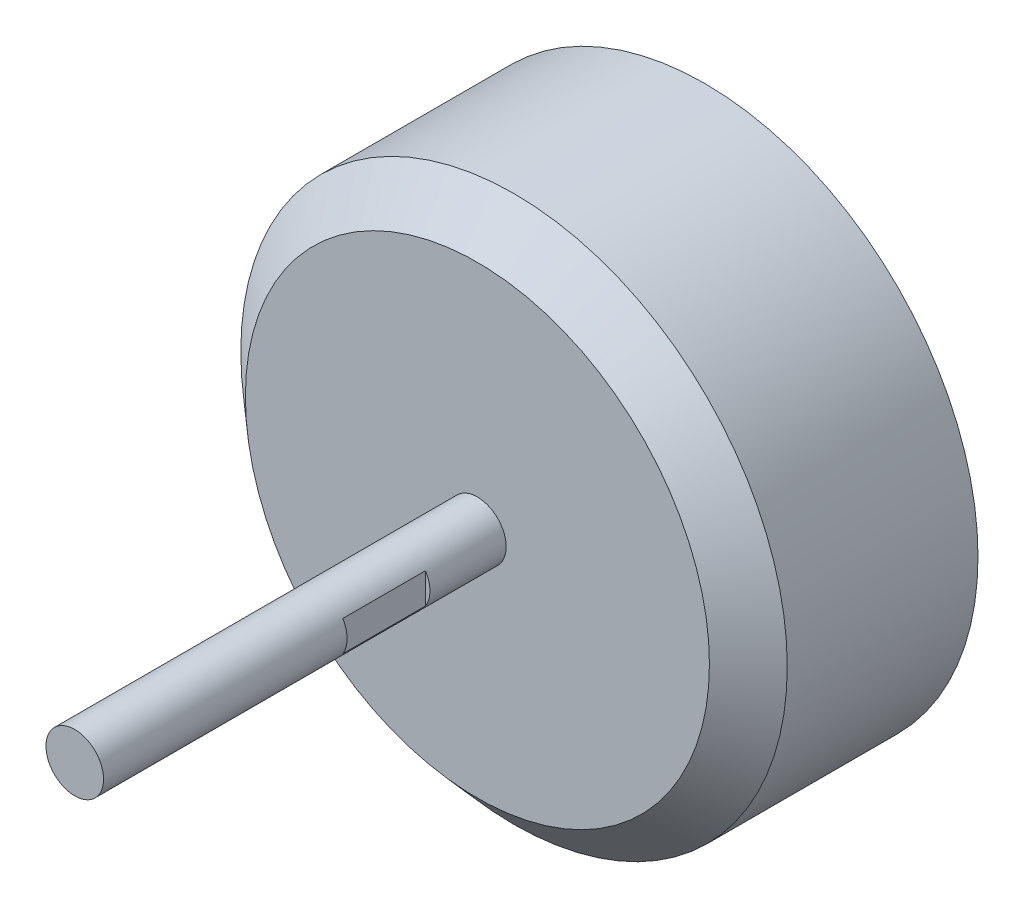
ISO-10303-21;
HEADER;
FILE_DESCRIPTION(('STEP AP214'),'2;1');
FILE_NAME('part.step','',(''),(''),'','','');
FILE_SCHEMA(('AUTOMOTIVE_DESIGN { 1 0 10303 214 1 1 1 1 }'));
ENDSEC;
DATA;
#1=APPLICATION_CONTEXT('core data for automotive mechanical design processes');
#2=APPLICATION_PROTOCOL_DEFINITION('international standard','automotive_design',2000,#1);
#3=PRODUCT_CONTEXT('',#1,'mechanical');
#4=PRODUCT('Part','Part','',(#3));
#5=PRODUCT_RELATED_PRODUCT_CATEGORY('part','',(#4));
#6=PRODUCT_DEFINITION_FORMATION('','',#4);
#7=PRODUCT_DEFINITION_CONTEXT('part definition',#1,'design');
#8=PRODUCT_DEFINITION('design','',#6,#7);
#9=PRODUCT_DEFINITION_SHAPE('','',#8);
#10=(LENGTH_UNIT() NAMED_UNIT(*) SI_UNIT(.MILLI.,.METRE.));
#11=(NAMED_UNIT(*) PLANE_ANGLE_UNIT() SI_UNIT($,.RADIAN.));
#12=(NAMED_UNIT(*) SI_UNIT($,.STERADIAN.) SOLID_ANGLE_UNIT());
#13=UNCERTAINTY_MEASURE_WITH_UNIT(LENGTH_MEASURE(1.E-05),#10,'distance_accuracy_value','');
#14=(GEOMETRIC_REPRESENTATION_CONTEXT(3) GLOBAL_UNCERTAINTY_ASSIGNED_CONTEXT((#13)) GLOBAL_UNIT_ASSIGNED_CONTEXT((#10,
#11,#12)) REPRESENTATION_CONTEXT('',''));
#15=CARTESIAN_POINT('',(0.,0.,0.));
#16=DIRECTION('',(0.,0.,1.));
#17=DIRECTION('',(1.,0.,0.));
#18=AXIS2_PLACEMENT_3D('',#15,#16,#17);
#19=CARTESIAN_POINT('',(0.,0.,0.));
#20=DIRECTION('',(0.,0.,1.));
#21=DIRECTION('',(1.,0.,0.));
#22=AXIS2_PLACEMENT_3D('',#19,#20,#21);
#23=PLANE('',#22);
#24=CARTESIAN_POINT('',(0.,0.,0.));
#25=DIRECTION('',(0.,0.,1.));
#26=DIRECTION('',(1.,0.,0.));
#27=AXIS2_PLACEMENT_3D('',#24,#25,#26);
#28=CIRCLE('',#27,14.325);
#29=CARTESIAN_POINT('',(14.325,0.,0.));
#30=VERTEX_POINT('',#29);
#31=EDGE_CURVE('E170',#30,#30,#28,.T.);
#32=ORIENTED_EDGE('',*,*,#31,.F.);
#33=EDGE_LOOP('',(#32));
#34=FACE_BOUND('',#33,.T.);
#35=CARTESIAN_POINT('',(0.,0.,0.));
#36=DIRECTION('',(0.,0.,1.));
#37=DIRECTION('',(1.,0.,0.));
#38=AXIS2_PLACEMENT_3D('',#35,#36,#37);
#39=CIRCLE('',#38,13.825);
#40=CARTESIAN_POINT('',(13.825,0.,0.));
#41=VERTEX_POINT('',#40);
#42=EDGE_CURVE('E167',#41,#41,#39,.T.);
#43=ORIENTED_EDGE('',*,*,#42,.T.);
#44=EDGE_LOOP('',(#43));
#45=FACE_BOUND('',#44,.T.);
#46=ADVANCED_FACE('F41',(#34,#45),#23,.F.);
#47=CARTESIAN_POINT('',(0.,0.,10.));
#48=DIRECTION('',(0.,0.,-1.));
#49=DIRECTION('',(-1.,0.,0.));
#50=AXIS2_PLACEMENT_3D('',#47,#48,#49);
#51=CYLINDRICAL_SURFACE('',#50,14.325);
#52=CARTESIAN_POINT('',(0.,0.,10.));
#53=DIRECTION('',(0.,0.,-1.));
#54=DIRECTION('',(-1.,0.,0.));
#55=AXIS2_PLACEMENT_3D('',#52,#53,#54);
#56=CIRCLE('',#55,14.325);
#57=CARTESIAN_POINT('',(-14.325,0.,10.));
#58=VERTEX_POINT('',#57);
#59=EDGE_CURVE('E173',#58,#58,#56,.F.);
#60=ORIENTED_EDGE('',*,*,#59,.F.);
#61=EDGE_LOOP('',(#60));
#62=FACE_BOUND('',#61,.T.);
#63=ORIENTED_EDGE('',*,*,#31,.T.);
#64=EDGE_LOOP('',(#63));
#65=FACE_BOUND('',#64,.T.);
#66=ADVANCED_FACE('F43',(#62,#65),#51,.T.);
#67=CARTESIAN_POINT('',(0.,0.,10.));
#68=DIRECTION('',(0.,0.,-1.));
#69=DIRECTION('',(-1.,0.,0.));
#70=AXIS2_PLACEMENT_3D('',#67,#68,#69);
#71=CYLINDRICAL_SURFACE('',#70,13.825);
#72=CARTESIAN_POINT('',(0.,0.,10.));
#73=DIRECTION('',(0.,0.,1.));
#74=DIRECTION('',(1.,0.,0.));
#75=AXIS2_PLACEMENT_3D('',#72,#73,#74);
#76=CIRCLE('',#75,13.825);
#77=CARTESIAN_POINT('',(13.825,0.,10.));
#78=VERTEX_POINT('',#77);
#79=EDGE_CURVE('E161',#78,#78,#76,.T.);
#80=ORIENTED_EDGE('',*,*,#79,.T.);
#81=EDGE_LOOP('',(#80));
#82=FACE_BOUND('',#81,.T.);
#83=ORIENTED_EDGE('',*,*,#42,.F.);
#84=EDGE_LOOP('',(#83));
#85=FACE_BOUND('',#84,.T.);
#86=ADVANCED_FACE('F130',(#82,#85),#71,.F.);
#87=CARTESIAN_POINT('',(0.,0.,10.));
#88=DIRECTION('',(0.,0.,1.));
#89=DIRECTION('',(1.,0.,0.));
#90=AXIS2_PLACEMENT_3D('',#87,#88,#89);
#91=PLANE('',#90);
#92=CARTESIAN_POINT('',(0.,0.,10.));
#93=DIRECTION('',(0.,0.,1.));
#94=DIRECTION('',(1.,0.,0.));
#95=AXIS2_PLACEMENT_3D('',#92,#93,#94);
#96=CIRCLE('',#95,1.51);
#97=CARTESIAN_POINT('',(1.51,0.,10.));
#98=VERTEX_POINT('',#97);
#99=EDGE_CURVE('E162',#98,#98,#96,.T.);
#100=ORIENTED_EDGE('',*,*,#99,.T.);
#101=EDGE_LOOP('',(#100));
#102=FACE_BOUND('',#101,.T.);
#103=ORIENTED_EDGE('',*,*,#79,.F.);
#104=EDGE_LOOP('',(#103));
#105=FACE_BOUND('',#104,.T.);
#106=ADVANCED_FACE('F137',(#102,#105),#91,.F.);
#107=CARTESIAN_POINT('',(0.,0.,11.92));
#108=DIRECTION('',(0.,0.,1.));
#109=DIRECTION('',(1.,0.,0.));
#110=AXIS2_PLACEMENT_3D('',#107,#108,#109);
#111=PLANE('',#110);
#112=CARTESIAN_POINT('',(0.,0.,11.92));
#113=DIRECTION('',(0.,0.,1.));
#114=DIRECTION('',(1.,0.,0.));
#115=AXIS2_PLACEMENT_3D('',#112,#113,#114);
#116=CIRCLE('',#115,1.51);
#117=CARTESIAN_POINT('',(1.51,0.,11.92));
#118=VERTEX_POINT('',#117);
#119=EDGE_CURVE('E85',#118,#118,#116,.T.);
#120=ORIENTED_EDGE('',*,*,#119,.F.);
#121=EDGE_LOOP('',(#120));
#122=FACE_BOUND('',#121,.T.);
#123=CARTESIAN_POINT('',(0.,0.,11.92));
#124=DIRECTION('',(0.,0.,1.));
#125=DIRECTION('',(1.,0.,0.));
#126=AXIS2_PLACEMENT_3D('',#123,#124,#125);
#127=CIRCLE('',#126,12.165);
#128=CARTESIAN_POINT('',(12.165,0.,11.92));
#129=VERTEX_POINT('',#128);
#130=EDGE_CURVE('E154',#129,#129,#127,.T.);
#131=ORIENTED_EDGE('',*,*,#130,.T.);
#132=EDGE_LOOP('',(#131));
#133=FACE_BOUND('',#132,.T.);
#134=ADVANCED_FACE('F139',(#122,#133),#111,.T.);
#135=CARTESIAN_POINT('',(0.,0.,11.92));
#136=DIRECTION('',(0.,0.,-1.));
#137=DIRECTION('',(-1.,0.,0.));
#138=AXIS2_PLACEMENT_3D('',#135,#136,#137);
#139=CONICAL_SURFACE('',#138,12.165,0.844153986113171);
#140=ORIENTED_EDGE('',*,*,#59,.T.);
#141=EDGE_LOOP('',(#140));
#142=FACE_BOUND('',#141,.T.);
#143=ORIENTED_EDGE('',*,*,#130,.F.);
#144=EDGE_LOOP('',(#143));
#145=FACE_BOUND('',#144,.T.);
#146=ADVANCED_FACE('F143',(#142,#145),#139,.T.);
#147=CARTESIAN_POINT('',(0.,0.,33.03));
#148=DIRECTION('',(0.,0.,1.));
#149=DIRECTION('',(1.,0.,0.));
#150=AXIS2_PLACEMENT_3D('',#147,#148,#149);
#151=PLANE('',#150);
#152=CARTESIAN_POINT('',(0.,0.,33.03));
#153=DIRECTION('',(0.,0.,1.));
#154=DIRECTION('',(1.,0.,0.));
#155=AXIS2_PLACEMENT_3D('',#152,#153,#154);
#156=CIRCLE('',#155,1.51);
#157=CARTESIAN_POINT('',(1.51,0.,33.03));
#158=VERTEX_POINT('',#157);
#159=EDGE_CURVE('E198',#158,#158,#156,.T.);
#160=ORIENTED_EDGE('',*,*,#159,.T.);
#161=EDGE_LOOP('',(#160));
#162=FACE_BOUND('',#161,.T.);
#163=ADVANCED_FACE('F215',(#162),#151,.T.);
#164=CARTESIAN_POINT('',(0.,0.,-5.31));
#165=DIRECTION('',(0.,0.,1.));
#166=DIRECTION('',(1.,0.,0.));
#167=AXIS2_PLACEMENT_3D('',#164,#165,#166);
#168=CYLINDRICAL_SURFACE('',#167,1.51);
#169=CARTESIAN_POINT('',(0.,0.,20.26));
#170=DIRECTION('',(0.,0.,1.));
#171=DIRECTION('',(1.,0.,0.));
#172=AXIS2_PLACEMENT_3D('',#169,#170,#171);
#173=CIRCLE('',#172,1.51);
#174=CARTESIAN_POINT('',(-1.28,-0.801061795369123,20.26));
#175=VERTEX_POINT('',#174);
#176=CARTESIAN_POINT('',(-1.28,0.801061795369123,20.26));
#177=VERTEX_POINT('',#176);
#178=EDGE_CURVE('E12',#175,#177,#173,.F.);
#179=ORIENTED_EDGE('',*,*,#178,.F.);
#180=DIRECTION('',(0.,0.,1.));
#181=VECTOR('',#180,1.);
#182=CARTESIAN_POINT('',(-1.28,-0.801061795369115,-5.31));
#183=LINE('',#182,#181);
#184=CARTESIAN_POINT('',(-1.28,-0.801061795369121,15.92));
#185=VERTEX_POINT('',#184);
#186=EDGE_CURVE('E104',#185,#175,#183,.T.);
#187=ORIENTED_EDGE('',*,*,#186,.F.);
#188=CARTESIAN_POINT('',(0.,0.,15.92));
#189=DIRECTION('',(0.,0.,-1.));
#190=DIRECTION('',(-1.,0.,0.));
#191=AXIS2_PLACEMENT_3D('',#188,#189,#190);
#192=CIRCLE('',#191,1.51);
#193=CARTESIAN_POINT('',(-1.28,0.801061795369121,15.92));
#194=VERTEX_POINT('',#193);
#195=EDGE_CURVE('E99',#194,#185,#192,.F.);
#196=ORIENTED_EDGE('',*,*,#195,.F.);
#197=DIRECTION('',(0.,0.,1.));
#198=VECTOR('',#197,1.);
#199=CARTESIAN_POINT('',(-1.28,0.801061795369115,-5.31));
#200=LINE('',#199,#198);
#201=EDGE_CURVE('E49',#177,#194,#200,.F.);
#202=ORIENTED_EDGE('',*,*,#201,.F.);
#203=EDGE_LOOP('',(#179,#187,#196,#202));
#204=FACE_BOUND('',#203,.T.);
#205=CARTESIAN_POINT('',(0.,0.,15.92));
#206=DIRECTION('',(0.,0.,-1.));
#207=DIRECTION('',(-1.,0.,0.));
#208=AXIS2_PLACEMENT_3D('',#205,#206,#207);
#209=CIRCLE('',#208,1.51);
#210=CARTESIAN_POINT('',(1.28,-0.801061795369121,15.92));
#211=VERTEX_POINT('',#210);
#212=CARTESIAN_POINT('',(1.28,0.801061795369121,15.92));
#213=VERTEX_POINT('',#212);
#214=EDGE_CURVE('E97',#211,#213,#209,.F.);
#215=ORIENTED_EDGE('',*,*,#214,.F.);
#216=DIRECTION('',(0.,0.,1.));
#217=VECTOR('',#216,1.);
#218=CARTESIAN_POINT('',(1.28,-0.801061795369115,-5.31));
#219=LINE('',#218,#217);
#220=CARTESIAN_POINT('',(1.28,-0.801061795369123,20.26));
#221=VERTEX_POINT('',#220);
#222=EDGE_CURVE('E90',#221,#211,#219,.F.);
#223=ORIENTED_EDGE('',*,*,#222,.F.);
#224=CARTESIAN_POINT('',(0.,0.,20.26));
#225=DIRECTION('',(0.,0.,1.));
#226=DIRECTION('',(1.,0.,0.));
#227=AXIS2_PLACEMENT_3D('',#224,#225,#226);
#228=CIRCLE('',#227,1.51);
#229=CARTESIAN_POINT('',(1.28,0.801061795369123,20.26));
#230=VERTEX_POINT('',#229);
#231=EDGE_CURVE('E79',#230,#221,#228,.F.);
#232=ORIENTED_EDGE('',*,*,#231,.F.);
#233=DIRECTION('',(0.,0.,1.));
#234=VECTOR('',#233,1.);
#235=CARTESIAN_POINT('',(1.28,0.801061795369115,-5.31));
#236=LINE('',#235,#234);
#237=EDGE_CURVE('E84',#213,#230,#236,.T.);
#238=ORIENTED_EDGE('',*,*,#237,.F.);
#239=EDGE_LOOP('',(#215,#223,#232,#238));
#240=FACE_BOUND('',#239,.T.);
#241=ORIENTED_EDGE('',*,*,#119,.T.);
#242=EDGE_LOOP('',(#241));
#243=FACE_BOUND('',#242,.T.);
#244=ORIENTED_EDGE('',*,*,#159,.F.);
#245=EDGE_LOOP('',(#244));
#246=FACE_BOUND('',#245,.T.);
#247=ADVANCED_FACE('F95',(#204,#240,#243,#246),#168,.T.);
#248=CARTESIAN_POINT('',(0.,0.,-5.31));
#249=DIRECTION('',(0.,0.,1.));
#250=DIRECTION('',(1.,0.,0.));
#251=AXIS2_PLACEMENT_3D('',#248,#249,#250);
#252=CIRCLE('',#251,1.51);
#253=CARTESIAN_POINT('',(1.51,0.,-5.31));
#254=VERTEX_POINT('',#253);
#255=EDGE_CURVE('E195',#254,#254,#252,.T.);
#256=ORIENTED_EDGE('',*,*,#255,.T.);
#257=EDGE_LOOP('',(#256));
#258=FACE_BOUND('',#257,.T.);
#259=ORIENTED_EDGE('',*,*,#99,.F.);
#260=EDGE_LOOP('',(#259));
#261=FACE_BOUND('',#260,.T.);
#262=ADVANCED_FACE('F221',(#258,#261),#168,.T.);
#263=CARTESIAN_POINT('',(0.,0.,-5.31));
#264=DIRECTION('',(0.,0.,1.));
#265=DIRECTION('',(1.,0.,0.));
#266=AXIS2_PLACEMENT_3D('',#263,#264,#265);
#267=PLANE('',#266);
#268=ORIENTED_EDGE('',*,*,#255,.F.);
#269=EDGE_LOOP('',(#268));
#270=FACE_BOUND('',#269,.T.);
#271=ADVANCED_FACE('F212',(#270),#267,.F.);
#272=CARTESIAN_POINT('',(1.28,-14.325,15.92));
#273=DIRECTION('',(-1.,0.,0.));
#274=DIRECTION('',(0.,0.,1.));
#275=AXIS2_PLACEMENT_3D('',#272,#273,#274);
#276=PLANE('',#275);
#277=ORIENTED_EDGE('',*,*,#222,.T.);
#278=DIRECTION('',(0.,1.,0.));
#279=VECTOR('',#278,1.);
#280=CARTESIAN_POINT('',(1.28,-14.325,15.92));
#281=LINE('',#280,#279);
#282=EDGE_CURVE('E92',#211,#213,#281,.T.);
#283=ORIENTED_EDGE('',*,*,#282,.T.);
#284=ORIENTED_EDGE('',*,*,#237,.T.);
#285=DIRECTION('',(0.,1.,0.));
#286=VECTOR('',#285,1.);
#287=CARTESIAN_POINT('',(1.28,-14.325,20.26));
#288=LINE('',#287,#286);
#289=EDGE_CURVE('E62',#221,#230,#288,.T.);
#290=ORIENTED_EDGE('',*,*,#289,.F.);
#291=EDGE_LOOP('',(#277,#283,#284,#290));
#292=FACE_BOUND('',#291,.T.);
#293=ADVANCED_FACE('F88',(#292),#276,.F.);
#294=CARTESIAN_POINT('',(1.28,-14.325,15.92));
#295=DIRECTION('',(0.,0.,-1.));
#296=DIRECTION('',(-1.,0.,0.));
#297=AXIS2_PLACEMENT_3D('',#294,#295,#296);
#298=PLANE('',#297);
#299=ORIENTED_EDGE('',*,*,#214,.T.);
#300=ORIENTED_EDGE('',*,*,#282,.F.);
#301=EDGE_LOOP('',(#299,#300));
#302=FACE_BOUND('',#301,.T.);
#303=ADVANCED_FACE('F204',(#302),#298,.F.);
#304=CARTESIAN_POINT('',(1.28,-14.325,20.26));
#305=DIRECTION('',(0.,0.,1.));
#306=DIRECTION('',(1.,0.,0.));
#307=AXIS2_PLACEMENT_3D('',#304,#305,#306);
#308=PLANE('',#307);
#309=ORIENTED_EDGE('',*,*,#231,.T.);
#310=ORIENTED_EDGE('',*,*,#289,.T.);
#311=EDGE_LOOP('',(#309,#310));
#312=FACE_BOUND('',#311,.T.);
#313=ADVANCED_FACE('F80',(#312),#308,.F.);
#314=CARTESIAN_POINT('',(-1.28,-14.325,15.92));
#315=DIRECTION('',(1.,0.,0.));
#316=DIRECTION('',(0.,0.,-1.));
#317=AXIS2_PLACEMENT_3D('',#314,#315,#316);
#318=PLANE('',#317);
#319=ORIENTED_EDGE('',*,*,#201,.T.);
#320=DIRECTION('',(0.,1.,0.));
#321=VECTOR('',#320,1.);
#322=CARTESIAN_POINT('',(-1.28,-14.325,15.92));
#323=LINE('',#322,#321);
#324=EDGE_CURVE('E55',#185,#194,#323,.T.);
#325=ORIENTED_EDGE('',*,*,#324,.F.);
#326=ORIENTED_EDGE('',*,*,#186,.T.);
#327=DIRECTION('',(0.,1.,0.));
#328=VECTOR('',#327,1.);
#329=CARTESIAN_POINT('',(-1.28,-14.325,20.26));
#330=LINE('',#329,#328);
#331=EDGE_CURVE('E112',#175,#177,#330,.T.);
#332=ORIENTED_EDGE('',*,*,#331,.T.);
#333=EDGE_LOOP('',(#319,#325,#326,#332));
#334=FACE_BOUND('',#333,.T.);
#335=ADVANCED_FACE('F109',(#334),#318,.F.);
#336=CARTESIAN_POINT('',(-1.28,-14.325,20.26));
#337=DIRECTION('',(0.,0.,1.));
#338=DIRECTION('',(1.,0.,0.));
#339=AXIS2_PLACEMENT_3D('',#336,#337,#338);
#340=PLANE('',#339);
#341=ORIENTED_EDGE('',*,*,#178,.T.);
#342=ORIENTED_EDGE('',*,*,#331,.F.);
#343=EDGE_LOOP('',(#341,#342));
#344=FACE_BOUND('',#343,.T.);
#345=ADVANCED_FACE('F117',(#344),#340,.F.);
#346=CARTESIAN_POINT('',(-1.28,-14.325,15.92));
#347=DIRECTION('',(0.,0.,-1.));
#348=DIRECTION('',(-1.,0.,0.));
#349=AXIS2_PLACEMENT_3D('',#346,#347,#348);
#350=PLANE('',#349);
#351=ORIENTED_EDGE('',*,*,#195,.T.);
#352=ORIENTED_EDGE('',*,*,#324,.T.);
#353=EDGE_LOOP('',(#351,#352));
#354=FACE_BOUND('',#353,.T.);
#355=ADVANCED_FACE('F115',(#354),#350,.F.);
#356=CLOSED_SHELL('',(#46,#66,#86,#106,#134,#146,#163,#247,#262,#271,#293,#303,#313,#335,#345,#355));
#357=MANIFOLD_SOLID_BREP('B2',#356);
#358=ADVANCED_BREP_SHAPE_REPRESENTATION('',(#18,#357),#14);
#359=SHAPE_DEFINITION_REPRESENTATION(#9,#358);
ENDSEC;
END-ISO-10303-21;
